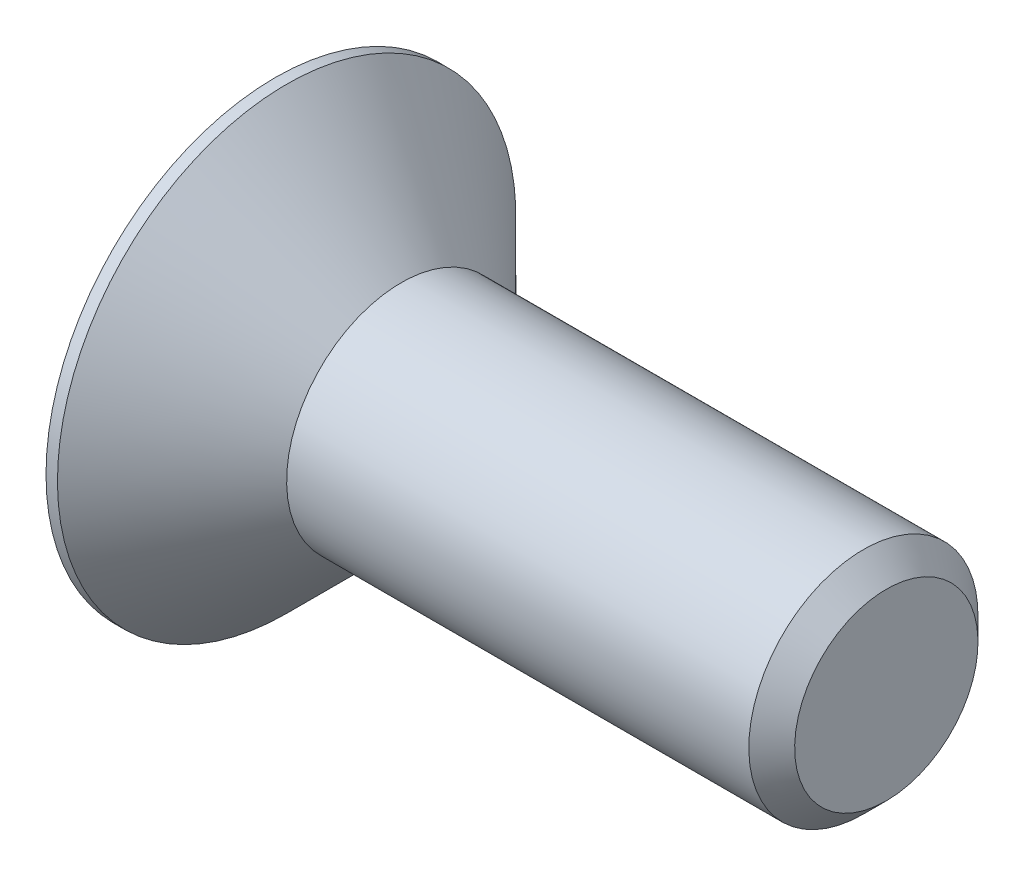
ISO-10303-21;
HEADER;
FILE_DESCRIPTION(('STEP AP214'),'2;1');
FILE_NAME('part.step','',(''),(''),'','','');
FILE_SCHEMA(('AUTOMOTIVE_DESIGN { 1 0 10303 214 1 1 1 1 }'));
ENDSEC;
DATA;
#1=APPLICATION_CONTEXT('core data for automotive mechanical design processes');
#2=APPLICATION_PROTOCOL_DEFINITION('international standard','automotive_design',2000,#1);
#3=PRODUCT_CONTEXT('',#1,'mechanical');
#4=PRODUCT('Part','Part','',(#3));
#5=PRODUCT_RELATED_PRODUCT_CATEGORY('part','',(#4));
#6=PRODUCT_DEFINITION_FORMATION('','',#4);
#7=PRODUCT_DEFINITION_CONTEXT('part definition',#1,'design');
#8=PRODUCT_DEFINITION('design','',#6,#7);
#9=PRODUCT_DEFINITION_SHAPE('','',#8);
#10=(LENGTH_UNIT() NAMED_UNIT(*) SI_UNIT(.MILLI.,.METRE.));
#11=(NAMED_UNIT(*) PLANE_ANGLE_UNIT() SI_UNIT($,.RADIAN.));
#12=(NAMED_UNIT(*) SI_UNIT($,.STERADIAN.) SOLID_ANGLE_UNIT());
#13=UNCERTAINTY_MEASURE_WITH_UNIT(LENGTH_MEASURE(1.E-05),#10,'distance_accuracy_value','');
#14=(GEOMETRIC_REPRESENTATION_CONTEXT(3) GLOBAL_UNCERTAINTY_ASSIGNED_CONTEXT((#13)) GLOBAL_UNIT_ASSIGNED_CONTEXT((#10,
#11,#12)) REPRESENTATION_CONTEXT('',''));
#15=CARTESIAN_POINT('',(0.,0.,0.));
#16=DIRECTION('',(0.,0.,1.));
#17=DIRECTION('',(1.,0.,0.));
#18=AXIS2_PLACEMENT_3D('',#15,#16,#17);
#19=CARTESIAN_POINT('',(1.65,4.7016225558442E-07,37.5000007598768));
#20=DIRECTION('',(-1.,0.,0.));
#21=DIRECTION('',(0.,-1.,0.));
#22=AXIS2_PLACEMENT_3D('',#19,#20,#21);
#23=PLANE('',#22);
#24=DIRECTION('',(0.,1.,0.));
#25=VECTOR('',#24,1.);
#26=CARTESIAN_POINT('',(1.65,4.70162347165903E-07,35.5000007598768));
#27=LINE('',#26,#25);
#28=CARTESIAN_POINT('',(1.65000000000003,1.15470100854155,35.5000007598768));
#29=VERTEX_POINT('',#28);
#30=CARTESIAN_POINT('',(1.6499999999999,-1.154700068217,35.5000007598768));
#31=VERTEX_POINT('',#30);
#32=EDGE_CURVE('E83',#29,#31,#27,.F.);
#33=ORIENTED_EDGE('',*,*,#32,.T.);
#34=DIRECTION('',(0.,0.5,-0.866025403784439));
#35=VECTOR('',#34,1.);
#36=CARTESIAN_POINT('',(1.64999999999987,-1.73205033740662,36.5000007598768));
#37=LINE('',#36,#35);
#38=CARTESIAN_POINT('',(1.64999999999987,-2.30940060659622,37.5000007598769));
#39=VERTEX_POINT('',#38);
#40=EDGE_CURVE('E67',#31,#39,#37,.F.);
#41=ORIENTED_EDGE('',*,*,#40,.T.);
#42=DIRECTION('',(0.,-0.5,-0.866025403784438));
#43=VECTOR('',#42,1.);
#44=CARTESIAN_POINT('',(1.64999999999987,-1.73205033740658,38.5000007598769));
#45=LINE('',#44,#43);
#46=CARTESIAN_POINT('',(1.64999999999993,-1.15470006821698,39.5000007598768));
#47=VERTEX_POINT('',#46);
#48=EDGE_CURVE('E72',#39,#47,#45,.F.);
#49=ORIENTED_EDGE('',*,*,#48,.T.);
#50=DIRECTION('',(0.,1.,0.));
#51=VECTOR('',#50,1.);
#52=CARTESIAN_POINT('',(1.65,4.70162349164305E-07,39.5000007598768));
#53=LINE('',#52,#51);
#54=CARTESIAN_POINT('',(1.6500000000001,1.15470100854151,39.5000007598768));
#55=VERTEX_POINT('',#54);
#56=EDGE_CURVE('E121',#47,#55,#53,.T.);
#57=ORIENTED_EDGE('',*,*,#56,.T.);
#58=DIRECTION('',(0.,-0.5,0.866025403784439));
#59=VECTOR('',#58,1.);
#60=CARTESIAN_POINT('',(1.65000000000013,1.73205127773114,38.5000007598768));
#61=LINE('',#60,#59);
#62=CARTESIAN_POINT('',(1.65000000000013,2.30940154692079,37.5000007598769));
#63=VERTEX_POINT('',#62);
#64=EDGE_CURVE('E125',#55,#63,#61,.F.);
#65=ORIENTED_EDGE('',*,*,#64,.T.);
#66=DIRECTION('',(0.,0.5,0.866025403784438));
#67=VECTOR('',#66,1.);
#68=CARTESIAN_POINT('',(1.65000000000013,1.73205127773117,36.5000007598769));
#69=LINE('',#68,#67);
#70=EDGE_CURVE('E130',#63,#29,#69,.F.);
#71=ORIENTED_EDGE('',*,*,#70,.T.);
#72=EDGE_LOOP('',(#33,#41,#49,#57,#65,#71));
#73=FACE_BOUND('',#72,.T.);
#74=ADVANCED_FACE('F17',(#73),#23,.T.);
#75=CARTESIAN_POINT('',(0.,-1.73205033740653,38.5000007598769));
#76=DIRECTION('',(0.,-0.866025403784438,0.5));
#77=DIRECTION('',(0.,-0.5,-0.866025403784438));
#78=AXIS2_PLACEMENT_3D('',#75,#76,#77);
#79=PLANE('',#78);
#80=DIRECTION('',(1.,0.,0.));
#81=VECTOR('',#80,1.);
#82=CARTESIAN_POINT('',(-1.29414183157876E-13,-2.30940060659614,37.5000007598769));
#83=LINE('',#82,#81);
#84=CARTESIAN_POINT('',(0.,-2.30940060659615,37.5000007598769));
#85=VERTEX_POINT('',#84);
#86=EDGE_CURVE('E74',#39,#85,#83,.F.);
#87=ORIENTED_EDGE('',*,*,#86,.T.);
#88=DIRECTION('',(0.,-0.499999999999999,-0.866025403784439));
#89=VECTOR('',#88,1.);
#90=CARTESIAN_POINT('',(0.,-1.1547000682169,39.5000007598769));
#91=LINE('',#90,#89);
#92=CARTESIAN_POINT('',(0.,-1.15470006821693,39.5000007598768));
#93=VERTEX_POINT('',#92);
#94=EDGE_CURVE('E119',#93,#85,#91,.T.);
#95=ORIENTED_EDGE('',*,*,#94,.F.);
#96=DIRECTION('',(1.,0.,0.));
#97=VECTOR('',#96,1.);
#98=CARTESIAN_POINT('',(0.,-1.1547000682169,39.5000007598769));
#99=LINE('',#98,#97);
#100=EDGE_CURVE('E77',#93,#47,#99,.T.);
#101=ORIENTED_EDGE('',*,*,#100,.T.);
#102=ORIENTED_EDGE('',*,*,#48,.F.);
#103=EDGE_LOOP('',(#87,#95,#101,#102));
#104=FACE_BOUND('',#103,.T.);
#105=ADVANCED_FACE('F73',(#104),#79,.F.);
#106=CARTESIAN_POINT('',(-1.29414183157876E-13,-1.73205033740653,36.5000007598769));
#107=DIRECTION('',(0.,-0.866025403784439,-0.5));
#108=DIRECTION('',(0.,0.5,-0.866025403784439));
#109=AXIS2_PLACEMENT_3D('',#106,#107,#108);
#110=PLANE('',#109);
#111=DIRECTION('',(-1.,0.,0.));
#112=VECTOR('',#111,1.);
#113=CARTESIAN_POINT('',(0.,-1.154700068217,35.5000007598769));
#114=LINE('',#113,#112);
#115=CARTESIAN_POINT('',(-1.29414183157876E-13,-1.15470006821693,35.5000007598769));
#116=VERTEX_POINT('',#115);
#117=EDGE_CURVE('E85',#31,#116,#114,.T.);
#118=ORIENTED_EDGE('',*,*,#117,.T.);
#119=DIRECTION('',(0.,0.500000000000001,-0.866025403784438));
#120=VECTOR('',#119,1.);
#121=CARTESIAN_POINT('',(-1.29536643793258E-13,-2.30940060659615,37.5000007598769));
#122=LINE('',#121,#120);
#123=EDGE_CURVE('E89',#85,#116,#122,.T.);
#124=ORIENTED_EDGE('',*,*,#123,.F.);
#125=ORIENTED_EDGE('',*,*,#86,.F.);
#126=ORIENTED_EDGE('',*,*,#40,.F.);
#127=EDGE_LOOP('',(#118,#124,#125,#126));
#128=FACE_BOUND('',#127,.T.);
#129=ADVANCED_FACE('F87',(#128),#110,.F.);
#130=CARTESIAN_POINT('',(0.,4.70162347165903E-07,35.5000007598769));
#131=DIRECTION('',(0.,0.,-1.));
#132=DIRECTION('',(-1.,0.,0.));
#133=AXIS2_PLACEMENT_3D('',#130,#131,#132);
#134=PLANE('',#133);
#135=DIRECTION('',(1.,0.,0.));
#136=VECTOR('',#135,1.);
#137=CARTESIAN_POINT('',(0.,1.15470100854153,35.5000007598768));
#138=LINE('',#137,#136);
#139=CARTESIAN_POINT('',(0.,1.15470100854158,35.5000007598769));
#140=VERTEX_POINT('',#139);
#141=EDGE_CURVE('E132',#29,#140,#138,.F.);
#142=ORIENTED_EDGE('',*,*,#141,.T.);
#143=DIRECTION('',(0.,-1.,0.));
#144=VECTOR('',#143,1.);
#145=CARTESIAN_POINT('',(0.,2.59807668151566,35.5000007598769));
#146=LINE('',#145,#144);
#147=EDGE_CURVE('E115',#116,#140,#146,.F.);
#148=ORIENTED_EDGE('',*,*,#147,.F.);
#149=ORIENTED_EDGE('',*,*,#117,.F.);
#150=ORIENTED_EDGE('',*,*,#32,.F.);
#151=EDGE_LOOP('',(#142,#148,#149,#150));
#152=FACE_BOUND('',#151,.T.);
#153=ADVANCED_FACE('F136',(#152),#134,.F.);
#154=CARTESIAN_POINT('',(0.,1.73205127773122,36.5000007598769));
#155=DIRECTION('',(0.,0.866025403784438,-0.5));
#156=DIRECTION('',(0.,0.5,0.866025403784438));
#157=AXIS2_PLACEMENT_3D('',#154,#155,#156);
#158=PLANE('',#157);
#159=DIRECTION('',(1.,0.,0.));
#160=VECTOR('',#159,1.);
#161=CARTESIAN_POINT('',(1.29276923162839E-13,2.30940154692087,37.5000007598769));
#162=LINE('',#161,#160);
#163=CARTESIAN_POINT('',(0.,2.30940154692085,37.5000007598769));
#164=VERTEX_POINT('',#163);
#165=EDGE_CURVE('E128',#63,#164,#162,.F.);
#166=ORIENTED_EDGE('',*,*,#165,.T.);
#167=DIRECTION('',(0.,0.5,0.866025403784438));
#168=VECTOR('',#167,1.);
#169=CARTESIAN_POINT('',(0.,1.1547010085416,35.5000007598769));
#170=LINE('',#169,#168);
#171=EDGE_CURVE('E109',#140,#164,#170,.T.);
#172=ORIENTED_EDGE('',*,*,#171,.F.);
#173=ORIENTED_EDGE('',*,*,#141,.F.);
#174=ORIENTED_EDGE('',*,*,#70,.F.);
#175=EDGE_LOOP('',(#166,#172,#173,#174));
#176=FACE_BOUND('',#175,.T.);
#177=ADVANCED_FACE('F145',(#176),#158,.F.);
#178=CARTESIAN_POINT('',(1.29276923162839E-13,1.73205127773123,38.5000007598769));
#179=DIRECTION('',(0.,0.866025403784439,0.5));
#180=DIRECTION('',(0.,-0.5,0.866025403784439));
#181=AXIS2_PLACEMENT_3D('',#178,#179,#180);
#182=PLANE('',#181);
#183=DIRECTION('',(1.,0.,0.));
#184=VECTOR('',#183,1.);
#185=CARTESIAN_POINT('',(0.,1.15470100854151,39.5000007598769));
#186=LINE('',#185,#184);
#187=CARTESIAN_POINT('',(1.2927692316284E-13,1.15470100854158,39.5000007598769));
#188=VERTEX_POINT('',#187);
#189=EDGE_CURVE('E35',#55,#188,#186,.F.);
#190=ORIENTED_EDGE('',*,*,#189,.T.);
#191=DIRECTION('',(0.,-0.499999999999999,0.866025403784439));
#192=VECTOR('',#191,1.);
#193=CARTESIAN_POINT('',(1.29399383798222E-13,2.30940154692085,37.5000007598769));
#194=LINE('',#193,#192);
#195=EDGE_CURVE('E105',#164,#188,#194,.T.);
#196=ORIENTED_EDGE('',*,*,#195,.F.);
#197=ORIENTED_EDGE('',*,*,#165,.F.);
#198=ORIENTED_EDGE('',*,*,#64,.F.);
#199=EDGE_LOOP('',(#190,#196,#197,#198));
#200=FACE_BOUND('',#199,.T.);
#201=ADVANCED_FACE('F143',(#200),#182,.F.);
#202=CARTESIAN_POINT('',(0.,4.70162349164305E-07,39.5000007598769));
#203=DIRECTION('',(0.,0.,1.));
#204=DIRECTION('',(1.,0.,0.));
#205=AXIS2_PLACEMENT_3D('',#202,#203,#204);
#206=PLANE('',#205);
#207=ORIENTED_EDGE('',*,*,#100,.F.);
#208=DIRECTION('',(0.,-1.,0.));
#209=VECTOR('',#208,1.);
#210=CARTESIAN_POINT('',(2.10071971149795E-13,2.59807668151566,39.5000007598769));
#211=LINE('',#210,#209);
#212=EDGE_CURVE('E101',#188,#93,#211,.T.);
#213=ORIENTED_EDGE('',*,*,#212,.F.);
#214=ORIENTED_EDGE('',*,*,#189,.F.);
#215=ORIENTED_EDGE('',*,*,#56,.F.);
#216=EDGE_LOOP('',(#207,#213,#214,#215));
#217=FACE_BOUND('',#216,.T.);
#218=ADVANCED_FACE('F141',(#217),#206,.F.);
#219=CARTESIAN_POINT('',(0.,2.59807668151566,36.0000007598769));
#220=DIRECTION('',(-1.,0.,0.));
#221=DIRECTION('',(0.,-1.,0.));
#222=AXIS2_PLACEMENT_3D('',#219,#220,#221);
#223=PLANE('',#222);
#224=CARTESIAN_POINT('',(0.,4.70162348165104E-07,37.5000007598768));
#225=DIRECTION('',(-1.,0.,0.));
#226=DIRECTION('',(0.,-1.,0.));
#227=AXIS2_PLACEMENT_3D('',#224,#225,#226);
#228=CIRCLE('',#227,6.);
#229=CARTESIAN_POINT('',(-3.36308331452563E-13,-5.99999952983765,37.5000007598768));
#230=VERTEX_POINT('',#229);
#231=EDGE_CURVE('E20',#230,#230,#228,.F.);
#232=ORIENTED_EDGE('',*,*,#231,.F.);
#233=EDGE_LOOP('',(#232));
#234=FACE_BOUND('',#233,.T.);
#235=ORIENTED_EDGE('',*,*,#195,.T.);
#236=ORIENTED_EDGE('',*,*,#212,.T.);
#237=ORIENTED_EDGE('',*,*,#94,.T.);
#238=ORIENTED_EDGE('',*,*,#123,.T.);
#239=ORIENTED_EDGE('',*,*,#147,.T.);
#240=ORIENTED_EDGE('',*,*,#171,.T.);
#241=EDGE_LOOP('',(#235,#236,#237,#238,#239,#240));
#242=FACE_BOUND('',#241,.T.);
#243=ADVANCED_FACE('F139',(#234,#242),#223,.T.);
#244=CARTESIAN_POINT('',(16.,1.29903857583811,36.7500007598763));
#245=DIRECTION('',(1.,0.,0.));
#246=DIRECTION('',(0.,1.,0.));
#247=AXIS2_PLACEMENT_3D('',#244,#245,#246);
#248=PLANE('',#247);
#249=CARTESIAN_POINT('',(15.9999999999628,4.70161452066142E-07,37.5000007598763));
#250=DIRECTION('',(-1.,0.,0.));
#251=DIRECTION('',(0.,-1.,0.));
#252=AXIS2_PLACEMENT_3D('',#249,#250,#251);
#253=CIRCLE('',#252,2.40000000002076);
#254=CARTESIAN_POINT('',(15.9999999999627,-2.3999995298593,37.5000007598763));
#255=VERTEX_POINT('',#254);
#256=EDGE_CURVE('E96',#255,#255,#253,.T.);
#257=ORIENTED_EDGE('',*,*,#256,.F.);
#258=EDGE_LOOP('',(#257));
#259=FACE_BOUND('',#258,.T.);
#260=ADVANCED_FACE('F175',(#259),#248,.T.);
#261=CARTESIAN_POINT('',(0.150000000000001,4.70162339757396E-07,37.5000007598768));
#262=DIRECTION('',(-1.,0.,0.));
#263=DIRECTION('',(0.,-1.,0.));
#264=AXIS2_PLACEMENT_3D('',#261,#262,#263);
#265=CYLINDRICAL_SURFACE('',#264,6.);
#266=ORIENTED_EDGE('',*,*,#231,.T.);
#267=EDGE_LOOP('',(#266));
#268=FACE_BOUND('',#267,.T.);
#269=CARTESIAN_POINT('',(0.300000000038186,4.70162331349688E-07,37.5000007598768));
#270=DIRECTION('',(-1.,0.,0.));
#271=DIRECTION('',(0.,0.866025403786786,-0.499999999995934));
#272=AXIS2_PLACEMENT_3D('',#269,#270,#271);
#273=CIRCLE('',#272,6.00000000007686);
#274=CARTESIAN_POINT('',(0.300000000038381,5.19615289294961,34.5000007598628));
#275=VERTEX_POINT('',#274);
#276=EDGE_CURVE('E94',#275,#275,#273,.F.);
#277=ORIENTED_EDGE('',*,*,#276,.F.);
#278=EDGE_LOOP('',(#277));
#279=FACE_BOUND('',#278,.T.);
#280=ADVANCED_FACE('F171',(#268,#279),#265,.T.);
#281=CARTESIAN_POINT('',(15.4000000000566,4.70161485481915E-07,37.5000007598763));
#282=DIRECTION('',(-1.,0.,0.));
#283=DIRECTION('',(0.,-1.,0.));
#284=AXIS2_PLACEMENT_3D('',#281,#282,#283);
#285=CONICAL_SURFACE('',#284,2.99999999992153,0.785398163392919);
#286=CARTESIAN_POINT('',(15.4,4.7016148497372E-07,37.5000007598763));
#287=DIRECTION('',(-1.,0.,0.));
#288=DIRECTION('',(0.,-1.,0.));
#289=AXIS2_PLACEMENT_3D('',#286,#287,#288);
#290=CIRCLE('',#289,3.);
#291=CARTESIAN_POINT('',(15.3999999999998,-2.99999952983852,37.5000007598763));
#292=VERTEX_POINT('',#291);
#293=EDGE_CURVE('E26',#292,#292,#290,.T.);
#294=ORIENTED_EDGE('',*,*,#293,.F.);
#295=EDGE_LOOP('',(#294));
#296=FACE_BOUND('',#295,.T.);
#297=ORIENTED_EDGE('',*,*,#256,.T.);
#298=EDGE_LOOP('',(#297));
#299=FACE_BOUND('',#298,.T.);
#300=ADVANCED_FACE('F163',(#296,#299),#285,.T.);
#301=CARTESIAN_POINT('',(0.300000000095029,4.7016233137645E-07,37.5000007598768));
#302=DIRECTION('',(-1.,0.,0.));
#303=DIRECTION('',(0.,-1.,0.));
#304=AXIS2_PLACEMENT_3D('',#301,#302,#303);
#305=CONICAL_SURFACE('',#304,6.00000000001342,0.785398163394542);
#306=CARTESIAN_POINT('',(3.3,4.70162163195521E-07,37.5000007598767));
#307=DIRECTION('',(-1.,0.,0.));
#308=DIRECTION('',(0.,-1.,0.));
#309=AXIS2_PLACEMENT_3D('',#306,#307,#308);
#310=CIRCLE('',#309,3.);
#311=CARTESIAN_POINT('',(3.29999999999983,-2.99999952983784,37.5000007598767));
#312=VERTEX_POINT('',#311);
#313=EDGE_CURVE('E11',#312,#312,#310,.F.);
#314=ORIENTED_EDGE('',*,*,#313,.F.);
#315=EDGE_LOOP('',(#314));
#316=FACE_BOUND('',#315,.T.);
#317=ORIENTED_EDGE('',*,*,#276,.T.);
#318=EDGE_LOOP('',(#317));
#319=FACE_BOUND('',#318,.T.);
#320=ADVANCED_FACE('F157',(#316,#319),#305,.T.);
#321=CARTESIAN_POINT('',(9.65,4.70161807269204E-07,37.5000007598765));
#322=DIRECTION('',(-1.,0.,0.));
#323=DIRECTION('',(0.,-1.,0.));
#324=AXIS2_PLACEMENT_3D('',#321,#322,#323);
#325=CYLINDRICAL_SURFACE('',#324,3.);
#326=ORIENTED_EDGE('',*,*,#293,.T.);
#327=EDGE_LOOP('',(#326));
#328=FACE_BOUND('',#327,.T.);
#329=ORIENTED_EDGE('',*,*,#313,.T.);
#330=EDGE_LOOP('',(#329));
#331=FACE_BOUND('',#330,.T.);
#332=ADVANCED_FACE('F155',(#328,#331),#325,.T.);
#333=CLOSED_SHELL('',(#74,#105,#129,#153,#177,#201,#218,#243,#260,#280,#300,#320,#332));
#334=MANIFOLD_SOLID_BREP('B1',#333);
#335=ADVANCED_BREP_SHAPE_REPRESENTATION('',(#18,#334),#14);
#336=SHAPE_DEFINITION_REPRESENTATION(#9,#335);
ENDSEC;
END-ISO-10303-21;
